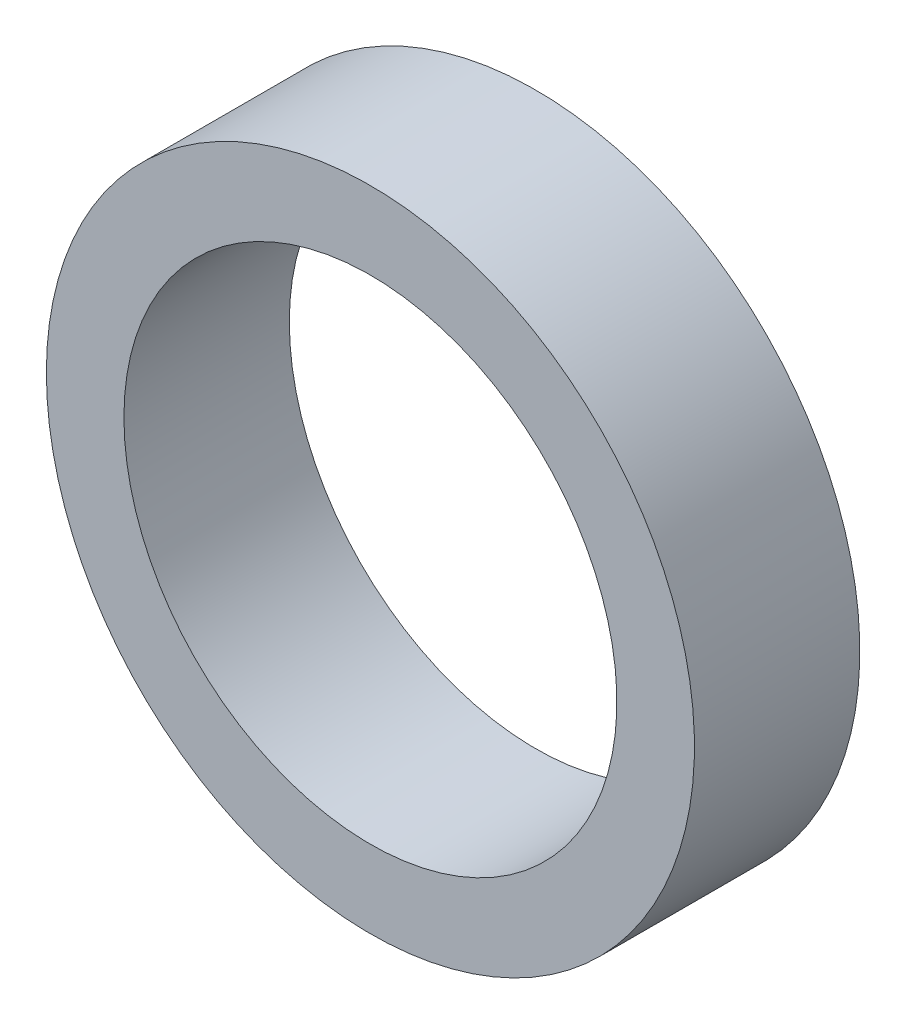
ISO-10303-21;
HEADER;
FILE_DESCRIPTION(('STEP AP214'),'2;1');
FILE_NAME('part.step','',(''),(''),'','','');
FILE_SCHEMA(('AUTOMOTIVE_DESIGN { 1 0 10303 214 1 1 1 1 }'));
ENDSEC;
DATA;
#1=APPLICATION_CONTEXT('core data for automotive mechanical design processes');
#2=APPLICATION_PROTOCOL_DEFINITION('international standard','automotive_design',2000,#1);
#3=PRODUCT_CONTEXT('',#1,'mechanical');
#4=PRODUCT('Part','Part','',(#3));
#5=PRODUCT_RELATED_PRODUCT_CATEGORY('part','',(#4));
#6=PRODUCT_DEFINITION_FORMATION('','',#4);
#7=PRODUCT_DEFINITION_CONTEXT('part definition',#1,'design');
#8=PRODUCT_DEFINITION('design','',#6,#7);
#9=PRODUCT_DEFINITION_SHAPE('','',#8);
#10=(LENGTH_UNIT() NAMED_UNIT(*) SI_UNIT(.MILLI.,.METRE.));
#11=(NAMED_UNIT(*) PLANE_ANGLE_UNIT() SI_UNIT($,.RADIAN.));
#12=(NAMED_UNIT(*) SI_UNIT($,.STERADIAN.) SOLID_ANGLE_UNIT());
#13=UNCERTAINTY_MEASURE_WITH_UNIT(LENGTH_MEASURE(1.E-05),#10,'distance_accuracy_value','');
#14=(GEOMETRIC_REPRESENTATION_CONTEXT(3) GLOBAL_UNCERTAINTY_ASSIGNED_CONTEXT((#13)) GLOBAL_UNIT_ASSIGNED_CONTEXT((#10,
#11,#12)) REPRESENTATION_CONTEXT('',''));
#15=CARTESIAN_POINT('',(0.,0.,0.));
#16=DIRECTION('',(0.,0.,1.));
#17=DIRECTION('',(1.,0.,0.));
#18=AXIS2_PLACEMENT_3D('',#15,#16,#17);
#19=CARTESIAN_POINT('',(40.,16.,9.68));
#20=DIRECTION('',(0.,0.,-1.));
#21=DIRECTION('',(-1.,0.,0.));
#22=AXIS2_PLACEMENT_3D('',#19,#20,#21);
#23=CYLINDRICAL_SURFACE('',#22,1.8928132);
#24=CARTESIAN_POINT('',(40.,16.,10.95));
#25=DIRECTION('',(0.,0.,-1.));
#26=DIRECTION('',(-1.,0.,0.));
#27=AXIS2_PLACEMENT_3D('',#24,#25,#26);
#28=CIRCLE('',#27,1.8928132);
#29=CARTESIAN_POINT('',(38.1071868,16.,10.95));
#30=VERTEX_POINT('',#29);
#31=EDGE_CURVE('E27',#30,#30,#28,.T.);
#32=ORIENTED_EDGE('',*,*,#31,.F.);
#33=EDGE_LOOP('',(#32));
#34=FACE_BOUND('',#33,.T.);
#35=CARTESIAN_POINT('',(40.,16.,9.68));
#36=DIRECTION('',(0.,0.,-1.));
#37=DIRECTION('',(-1.,0.,0.));
#38=AXIS2_PLACEMENT_3D('',#35,#36,#37);
#39=CIRCLE('',#38,1.8928132);
#40=CARTESIAN_POINT('',(38.1071868,16.,9.68));
#41=VERTEX_POINT('',#40);
#42=EDGE_CURVE('E18',#41,#41,#39,.T.);
#43=ORIENTED_EDGE('',*,*,#42,.T.);
#44=EDGE_LOOP('',(#43));
#45=FACE_BOUND('',#44,.T.);
#46=ADVANCED_FACE('F15',(#34,#45),#23,.F.);
#47=CARTESIAN_POINT('',(27.99999999999,16.000000000005,9.68));
#48=DIRECTION('',(0.,0.,1.));
#49=DIRECTION('',(1.,0.,0.));
#50=AXIS2_PLACEMENT_3D('',#47,#48,#49);
#51=PLANE('',#50);
#52=CARTESIAN_POINT('',(40.,16.,9.68));
#53=DIRECTION('',(0.,0.,-1.));
#54=DIRECTION('',(-1.,0.,0.));
#55=AXIS2_PLACEMENT_3D('',#52,#53,#54);
#56=CIRCLE('',#55,2.4883755);
#57=CARTESIAN_POINT('',(37.5116245,16.,9.68));
#58=VERTEX_POINT('',#57);
#59=EDGE_CURVE('E22',#58,#58,#56,.F.);
#60=ORIENTED_EDGE('',*,*,#59,.F.);
#61=EDGE_LOOP('',(#60));
#62=FACE_BOUND('',#61,.T.);
#63=ORIENTED_EDGE('',*,*,#42,.F.);
#64=EDGE_LOOP('',(#63));
#65=FACE_BOUND('',#64,.T.);
#66=ADVANCED_FACE('F36',(#62,#65),#51,.F.);
#67=CARTESIAN_POINT('',(27.99999999999,16.000000000005,10.95));
#68=DIRECTION('',(0.,0.,1.));
#69=DIRECTION('',(1.,0.,0.));
#70=AXIS2_PLACEMENT_3D('',#67,#68,#69);
#71=PLANE('',#70);
#72=CARTESIAN_POINT('',(40.,16.,10.95));
#73=DIRECTION('',(0.,0.,-1.));
#74=DIRECTION('',(-1.,0.,0.));
#75=AXIS2_PLACEMENT_3D('',#72,#73,#74);
#76=CIRCLE('',#75,2.4883755);
#77=CARTESIAN_POINT('',(37.5116245,16.,10.95));
#78=VERTEX_POINT('',#77);
#79=EDGE_CURVE('E10',#78,#78,#76,.T.);
#80=ORIENTED_EDGE('',*,*,#79,.F.);
#81=EDGE_LOOP('',(#80));
#82=FACE_BOUND('',#81,.T.);
#83=ORIENTED_EDGE('',*,*,#31,.T.);
#84=EDGE_LOOP('',(#83));
#85=FACE_BOUND('',#84,.T.);
#86=ADVANCED_FACE('F38',(#82,#85),#71,.T.);
#87=CARTESIAN_POINT('',(40.,16.,9.68));
#88=DIRECTION('',(0.,0.,-1.));
#89=DIRECTION('',(-1.,0.,0.));
#90=AXIS2_PLACEMENT_3D('',#87,#88,#89);
#91=CYLINDRICAL_SURFACE('',#90,2.4883755);
#92=ORIENTED_EDGE('',*,*,#79,.T.);
#93=EDGE_LOOP('',(#92));
#94=FACE_BOUND('',#93,.T.);
#95=ORIENTED_EDGE('',*,*,#59,.T.);
#96=EDGE_LOOP('',(#95));
#97=FACE_BOUND('',#96,.T.);
#98=ADVANCED_FACE('F45',(#94,#97),#91,.T.);
#99=CLOSED_SHELL('',(#46,#66,#86,#98));
#100=MANIFOLD_SOLID_BREP('B1',#99);
#101=ADVANCED_BREP_SHAPE_REPRESENTATION('',(#18,#100),#14);
#102=SHAPE_DEFINITION_REPRESENTATION(#9,#101);
ENDSEC;
END-ISO-10303-21;
